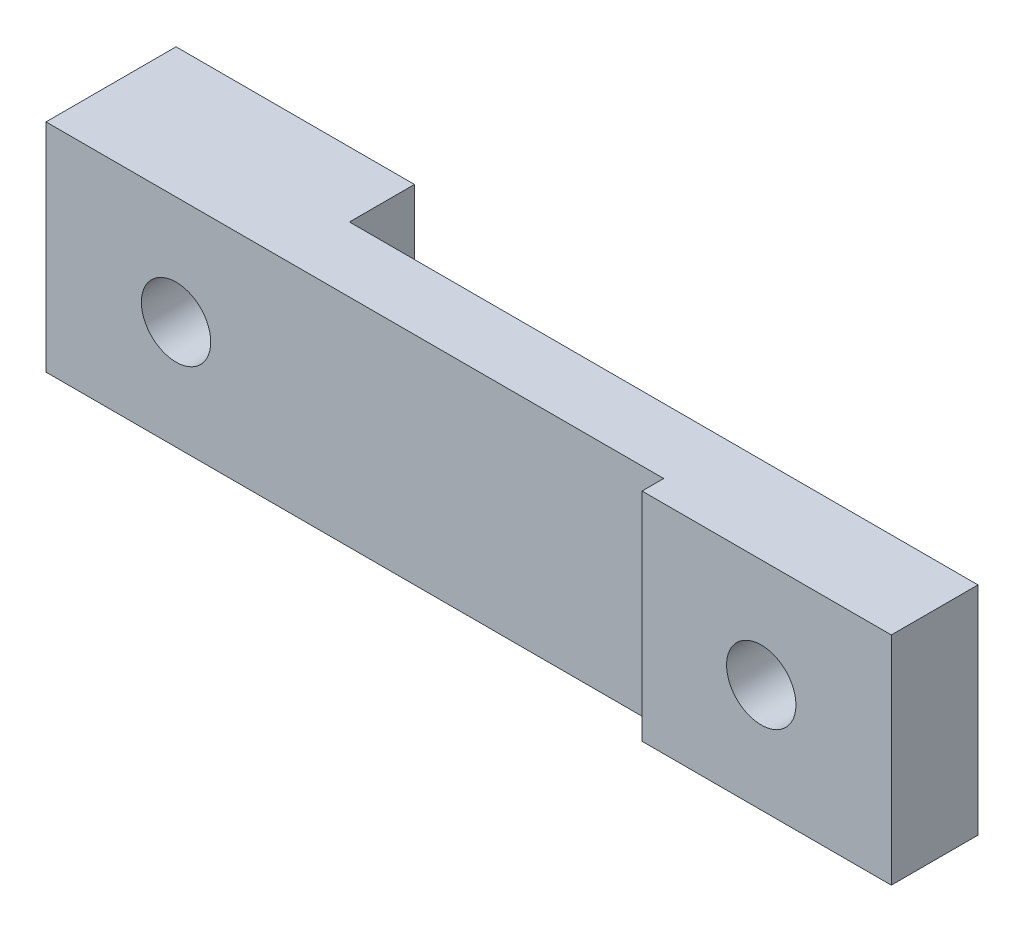
ISO-10303-21;
HEADER;
FILE_DESCRIPTION(('STEP AP214'),'2;1');
FILE_NAME('part.step','',(''),(''),'','','');
FILE_SCHEMA(('AUTOMOTIVE_DESIGN { 1 0 10303 214 1 1 1 1 }'));
ENDSEC;
DATA;
#1=APPLICATION_CONTEXT('core data for automotive mechanical design processes');
#2=APPLICATION_PROTOCOL_DEFINITION('international standard','automotive_design',2000,#1);
#3=PRODUCT_CONTEXT('',#1,'mechanical');
#4=PRODUCT('Part','Part','',(#3));
#5=PRODUCT_RELATED_PRODUCT_CATEGORY('part','',(#4));
#6=PRODUCT_DEFINITION_FORMATION('','',#4);
#7=PRODUCT_DEFINITION_CONTEXT('part definition',#1,'design');
#8=PRODUCT_DEFINITION('design','',#6,#7);
#9=PRODUCT_DEFINITION_SHAPE('','',#8);
#10=(LENGTH_UNIT() NAMED_UNIT(*) SI_UNIT(.MILLI.,.METRE.));
#11=(NAMED_UNIT(*) PLANE_ANGLE_UNIT() SI_UNIT($,.RADIAN.));
#12=(NAMED_UNIT(*) SI_UNIT($,.STERADIAN.) SOLID_ANGLE_UNIT());
#13=UNCERTAINTY_MEASURE_WITH_UNIT(LENGTH_MEASURE(1.E-05),#10,'distance_accuracy_value','');
#14=(GEOMETRIC_REPRESENTATION_CONTEXT(3) GLOBAL_UNCERTAINTY_ASSIGNED_CONTEXT((#13)) GLOBAL_UNIT_ASSIGNED_CONTEXT((#10,
#11,#12)) REPRESENTATION_CONTEXT('',''));
#15=CARTESIAN_POINT('',(0.,0.,0.));
#16=DIRECTION('',(0.,0.,1.));
#17=DIRECTION('',(1.,0.,0.));
#18=AXIS2_PLACEMENT_3D('',#15,#16,#17);
#19=CARTESIAN_POINT('',(-17.5,5.,3.));
#20=DIRECTION('',(0.,-1.,0.));
#21=DIRECTION('',(0.,0.,-1.));
#22=AXIS2_PLACEMENT_3D('',#19,#20,#21);
#23=PLANE('',#22);
#24=DIRECTION('',(0.,0.,-1.));
#25=VECTOR('',#24,1.);
#26=CARTESIAN_POINT('',(-20.,5.,-3.));
#27=LINE('',#26,#25);
#28=CARTESIAN_POINT('',(-20.,5.,3.));
#29=VERTEX_POINT('',#28);
#30=CARTESIAN_POINT('',(-20.,5.,-3.));
#31=VERTEX_POINT('',#30);
#32=EDGE_CURVE('E50',#29,#31,#27,.T.);
#33=ORIENTED_EDGE('',*,*,#32,.F.);
#34=DIRECTION('',(-1.,0.,0.));
#35=VECTOR('',#34,1.);
#36=CARTESIAN_POINT('',(-17.5,5.,3.));
#37=LINE('',#36,#35);
#38=CARTESIAN_POINT('',(8.5,5.,3.));
#39=VERTEX_POINT('',#38);
#40=EDGE_CURVE('E43',#39,#29,#37,.T.);
#41=ORIENTED_EDGE('',*,*,#40,.F.);
#42=DIRECTION('',(0.,0.,-1.));
#43=VECTOR('',#42,1.);
#44=CARTESIAN_POINT('',(8.5,5.,4.));
#45=LINE('',#44,#43);
#46=CARTESIAN_POINT('',(8.5,5.,4.));
#47=VERTEX_POINT('',#46);
#48=EDGE_CURVE('E139',#47,#39,#45,.T.);
#49=ORIENTED_EDGE('',*,*,#48,.F.);
#50=DIRECTION('',(-1.,0.,0.));
#51=VECTOR('',#50,1.);
#52=CARTESIAN_POINT('',(8.5,5.,4.));
#53=LINE('',#52,#51);
#54=CARTESIAN_POINT('',(20.,5.00000000000001,4.));
#55=VERTEX_POINT('',#54);
#56=EDGE_CURVE('E120',#55,#47,#53,.T.);
#57=ORIENTED_EDGE('',*,*,#56,.F.);
#58=DIRECTION('',(0.,0.,1.));
#59=VECTOR('',#58,1.);
#60=CARTESIAN_POINT('',(20.,5.00000000000001,4.));
#61=LINE('',#60,#59);
#62=CARTESIAN_POINT('',(20.,5.00000000000001,0.));
#63=VERTEX_POINT('',#62);
#64=EDGE_CURVE('E173',#63,#55,#61,.T.);
#65=ORIENTED_EDGE('',*,*,#64,.F.);
#66=DIRECTION('',(-1.,0.,0.));
#67=VECTOR('',#66,1.);
#68=CARTESIAN_POINT('',(-17.5,5.,0.));
#69=LINE('',#68,#67);
#70=CARTESIAN_POINT('',(-9.00000000000001,5.00000000000001,0.));
#71=VERTEX_POINT('',#70);
#72=EDGE_CURVE('E144',#63,#71,#69,.T.);
#73=ORIENTED_EDGE('',*,*,#72,.T.);
#74=DIRECTION('',(0.,0.,1.));
#75=VECTOR('',#74,1.);
#76=CARTESIAN_POINT('',(-9.00000000000001,5.00000000000001,0.));
#77=LINE('',#76,#75);
#78=CARTESIAN_POINT('',(-9.00000000000001,5.00000000000001,-3.));
#79=VERTEX_POINT('',#78);
#80=EDGE_CURVE('E228',#79,#71,#77,.T.);
#81=ORIENTED_EDGE('',*,*,#80,.F.);
#82=DIRECTION('',(1.,0.,0.));
#83=VECTOR('',#82,1.);
#84=CARTESIAN_POINT('',(-11.5,5.,-3.));
#85=LINE('',#84,#83);
#86=EDGE_CURVE('E118',#31,#79,#85,.T.);
#87=ORIENTED_EDGE('',*,*,#86,.F.);
#88=EDGE_LOOP('',(#33,#41,#49,#57,#65,#73,#81,#87));
#89=FACE_BOUND('',#88,.T.);
#90=ADVANCED_FACE('F35',(#89),#23,.F.);
#91=CARTESIAN_POINT('',(-17.5,-5.,3.));
#92=DIRECTION('',(0.,1.,0.));
#93=DIRECTION('',(0.,0.,1.));
#94=AXIS2_PLACEMENT_3D('',#91,#92,#93);
#95=PLANE('',#94);
#96=DIRECTION('',(0.,0.,1.));
#97=VECTOR('',#96,1.);
#98=CARTESIAN_POINT('',(-20.,-5.,-3.));
#99=LINE('',#98,#97);
#100=CARTESIAN_POINT('',(-20.,-5.,-3.));
#101=VERTEX_POINT('',#100);
#102=CARTESIAN_POINT('',(-20.,-5.,3.));
#103=VERTEX_POINT('',#102);
#104=EDGE_CURVE('E100',#101,#103,#99,.T.);
#105=ORIENTED_EDGE('',*,*,#104,.F.);
#106=DIRECTION('',(-1.,0.,0.));
#107=VECTOR('',#106,1.);
#108=CARTESIAN_POINT('',(-11.5,-5.,-3.));
#109=LINE('',#108,#107);
#110=CARTESIAN_POINT('',(-9.00000000000001,-5.,-3.));
#111=VERTEX_POINT('',#110);
#112=EDGE_CURVE('E109',#111,#101,#109,.T.);
#113=ORIENTED_EDGE('',*,*,#112,.F.);
#114=DIRECTION('',(0.,0.,-1.));
#115=VECTOR('',#114,1.);
#116=CARTESIAN_POINT('',(-9.00000000000001,-5.,0.));
#117=LINE('',#116,#115);
#118=CARTESIAN_POINT('',(-9.00000000000001,-5.,0.));
#119=VERTEX_POINT('',#118);
#120=EDGE_CURVE('E234',#119,#111,#117,.T.);
#121=ORIENTED_EDGE('',*,*,#120,.F.);
#122=DIRECTION('',(1.,0.,0.));
#123=VECTOR('',#122,1.);
#124=CARTESIAN_POINT('',(-17.5,-5.,0.));
#125=LINE('',#124,#123);
#126=CARTESIAN_POINT('',(20.,-5.,0.));
#127=VERTEX_POINT('',#126);
#128=EDGE_CURVE('E150',#119,#127,#125,.T.);
#129=ORIENTED_EDGE('',*,*,#128,.T.);
#130=DIRECTION('',(0.,0.,-1.));
#131=VECTOR('',#130,1.);
#132=CARTESIAN_POINT('',(20.,-5.,4.));
#133=LINE('',#132,#131);
#134=CARTESIAN_POINT('',(20.,-5.,4.));
#135=VERTEX_POINT('',#134);
#136=EDGE_CURVE('E180',#135,#127,#133,.T.);
#137=ORIENTED_EDGE('',*,*,#136,.F.);
#138=DIRECTION('',(1.,0.,0.));
#139=VECTOR('',#138,1.);
#140=CARTESIAN_POINT('',(8.5,-5.,4.));
#141=LINE('',#140,#139);
#142=CARTESIAN_POINT('',(8.5,-5.,4.));
#143=VERTEX_POINT('',#142);
#144=EDGE_CURVE('E129',#143,#135,#141,.T.);
#145=ORIENTED_EDGE('',*,*,#144,.F.);
#146=DIRECTION('',(0.,0.,-1.));
#147=VECTOR('',#146,1.);
#148=CARTESIAN_POINT('',(8.5,-5.,4.));
#149=LINE('',#148,#147);
#150=CARTESIAN_POINT('',(8.5,-5.,3.));
#151=VERTEX_POINT('',#150);
#152=EDGE_CURVE('E131',#143,#151,#149,.T.);
#153=ORIENTED_EDGE('',*,*,#152,.T.);
#154=DIRECTION('',(1.,0.,0.));
#155=VECTOR('',#154,1.);
#156=CARTESIAN_POINT('',(-17.5,-5.,3.));
#157=LINE('',#156,#155);
#158=EDGE_CURVE('E11',#103,#151,#157,.T.);
#159=ORIENTED_EDGE('',*,*,#158,.F.);
#160=EDGE_LOOP('',(#105,#113,#121,#129,#137,#145,#153,#159));
#161=FACE_BOUND('',#160,.T.);
#162=ADVANCED_FACE('F108',(#161),#95,.F.);
#163=CARTESIAN_POINT('',(0.,0.,3.));
#164=DIRECTION('',(0.,0.,1.));
#165=DIRECTION('',(1.,0.,0.));
#166=AXIS2_PLACEMENT_3D('',#163,#164,#165);
#167=PLANE('',#166);
#168=CARTESIAN_POINT('',(-14.,0.,3.));
#169=DIRECTION('',(0.,0.,1.));
#170=DIRECTION('',(1.,0.,0.));
#171=AXIS2_PLACEMENT_3D('',#168,#169,#170);
#172=CIRCLE('',#171,1.6);
#173=CARTESIAN_POINT('',(-12.4,0.,3.));
#174=VERTEX_POINT('',#173);
#175=EDGE_CURVE('E182',#174,#174,#172,.T.);
#176=ORIENTED_EDGE('',*,*,#175,.F.);
#177=EDGE_LOOP('',(#176));
#178=FACE_BOUND('',#177,.T.);
#179=ORIENTED_EDGE('',*,*,#40,.T.);
#180=DIRECTION('',(0.,1.,0.));
#181=VECTOR('',#180,1.);
#182=CARTESIAN_POINT('',(-20.,5.,3.));
#183=LINE('',#182,#181);
#184=EDGE_CURVE('E112',#103,#29,#183,.T.);
#185=ORIENTED_EDGE('',*,*,#184,.F.);
#186=ORIENTED_EDGE('',*,*,#158,.T.);
#187=DIRECTION('',(0.,-1.,0.));
#188=VECTOR('',#187,1.);
#189=CARTESIAN_POINT('',(8.5,5.,3.));
#190=LINE('',#189,#188);
#191=EDGE_CURVE('E57',#39,#151,#190,.T.);
#192=ORIENTED_EDGE('',*,*,#191,.F.);
#193=EDGE_LOOP('',(#179,#185,#186,#192));
#194=FACE_BOUND('',#193,.T.);
#195=ADVANCED_FACE('F157',(#178,#194),#167,.T.);
#196=CARTESIAN_POINT('',(0.,0.,-3.));
#197=DIRECTION('',(0.,0.,-1.));
#198=DIRECTION('',(-1.,0.,0.));
#199=AXIS2_PLACEMENT_3D('',#196,#197,#198);
#200=PLANE('',#199);
#201=CARTESIAN_POINT('',(-14.,0.,-3.));
#202=DIRECTION('',(0.,0.,-1.));
#203=DIRECTION('',(-1.,0.,0.));
#204=AXIS2_PLACEMENT_3D('',#201,#202,#203);
#205=CIRCLE('',#204,1.6);
#206=CARTESIAN_POINT('',(-15.6,0.,-3.));
#207=VERTEX_POINT('',#206);
#208=EDGE_CURVE('E226',#207,#207,#205,.T.);
#209=ORIENTED_EDGE('',*,*,#208,.F.);
#210=EDGE_LOOP('',(#209));
#211=FACE_BOUND('',#210,.T.);
#212=ORIENTED_EDGE('',*,*,#112,.T.);
#213=DIRECTION('',(0.,-1.,0.));
#214=VECTOR('',#213,1.);
#215=CARTESIAN_POINT('',(-20.,5.,-3.));
#216=LINE('',#215,#214);
#217=EDGE_CURVE('E97',#31,#101,#216,.T.);
#218=ORIENTED_EDGE('',*,*,#217,.F.);
#219=ORIENTED_EDGE('',*,*,#86,.T.);
#220=DIRECTION('',(0.,1.,0.));
#221=VECTOR('',#220,1.);
#222=CARTESIAN_POINT('',(-9.00000000000001,5.00000000000001,-3.));
#223=LINE('',#222,#221);
#224=EDGE_CURVE('E117',#111,#79,#223,.T.);
#225=ORIENTED_EDGE('',*,*,#224,.F.);
#226=EDGE_LOOP('',(#212,#218,#219,#225));
#227=FACE_BOUND('',#226,.T.);
#228=ADVANCED_FACE('F115',(#211,#227),#200,.T.);
#229=CARTESIAN_POINT('',(0.,0.,0.));
#230=DIRECTION('',(0.,0.,1.));
#231=DIRECTION('',(1.,0.,0.));
#232=AXIS2_PLACEMENT_3D('',#229,#230,#231);
#233=PLANE('',#232);
#234=ORIENTED_EDGE('',*,*,#128,.F.);
#235=DIRECTION('',(0.,-1.,0.));
#236=VECTOR('',#235,1.);
#237=CARTESIAN_POINT('',(-9.00000000000001,5.00000000000001,0.));
#238=LINE('',#237,#236);
#239=EDGE_CURVE('E236',#71,#119,#238,.T.);
#240=ORIENTED_EDGE('',*,*,#239,.F.);
#241=ORIENTED_EDGE('',*,*,#72,.F.);
#242=DIRECTION('',(0.,1.,0.));
#243=VECTOR('',#242,1.);
#244=CARTESIAN_POINT('',(20.,5.00000000000001,0.));
#245=LINE('',#244,#243);
#246=EDGE_CURVE('E178',#127,#63,#245,.T.);
#247=ORIENTED_EDGE('',*,*,#246,.F.);
#248=EDGE_LOOP('',(#234,#240,#241,#247));
#249=FACE_BOUND('',#248,.T.);
#250=CARTESIAN_POINT('',(14.,0.,0.));
#251=DIRECTION('',(0.,0.,1.));
#252=DIRECTION('',(1.,0.,0.));
#253=AXIS2_PLACEMENT_3D('',#250,#251,#252);
#254=CIRCLE('',#253,1.6);
#255=CARTESIAN_POINT('',(15.6,0.,0.));
#256=VERTEX_POINT('',#255);
#257=EDGE_CURVE('E186',#256,#256,#254,.T.);
#258=ORIENTED_EDGE('',*,*,#257,.T.);
#259=EDGE_LOOP('',(#258));
#260=FACE_BOUND('',#259,.T.);
#261=ADVANCED_FACE('F216',(#249,#260),#233,.F.);
#262=CARTESIAN_POINT('',(0.,0.,4.));
#263=DIRECTION('',(0.,0.,1.));
#264=DIRECTION('',(1.,0.,0.));
#265=AXIS2_PLACEMENT_3D('',#262,#263,#264);
#266=PLANE('',#265);
#267=ORIENTED_EDGE('',*,*,#144,.T.);
#268=DIRECTION('',(0.,-1.,0.));
#269=VECTOR('',#268,1.);
#270=CARTESIAN_POINT('',(20.,5.00000000000001,4.));
#271=LINE('',#270,#269);
#272=EDGE_CURVE('E170',#55,#135,#271,.T.);
#273=ORIENTED_EDGE('',*,*,#272,.F.);
#274=ORIENTED_EDGE('',*,*,#56,.T.);
#275=DIRECTION('',(0.,-1.,0.));
#276=VECTOR('',#275,1.);
#277=CARTESIAN_POINT('',(8.5,5.,4.));
#278=LINE('',#277,#276);
#279=EDGE_CURVE('E127',#47,#143,#278,.T.);
#280=ORIENTED_EDGE('',*,*,#279,.T.);
#281=EDGE_LOOP('',(#267,#273,#274,#280));
#282=FACE_BOUND('',#281,.T.);
#283=CARTESIAN_POINT('',(14.,0.,4.));
#284=DIRECTION('',(0.,0.,1.));
#285=DIRECTION('',(1.,0.,0.));
#286=AXIS2_PLACEMENT_3D('',#283,#284,#285);
#287=CIRCLE('',#286,1.6);
#288=CARTESIAN_POINT('',(15.6,0.,4.));
#289=VERTEX_POINT('',#288);
#290=EDGE_CURVE('E122',#289,#289,#287,.F.);
#291=ORIENTED_EDGE('',*,*,#290,.T.);
#292=EDGE_LOOP('',(#291));
#293=FACE_BOUND('',#292,.T.);
#294=ADVANCED_FACE('F166',(#282,#293),#266,.T.);
#295=CARTESIAN_POINT('',(8.5,5.,4.));
#296=DIRECTION('',(1.,0.,0.));
#297=DIRECTION('',(0.,0.,-1.));
#298=AXIS2_PLACEMENT_3D('',#295,#296,#297);
#299=PLANE('',#298);
#300=ORIENTED_EDGE('',*,*,#191,.T.);
#301=ORIENTED_EDGE('',*,*,#152,.F.);
#302=ORIENTED_EDGE('',*,*,#279,.F.);
#303=ORIENTED_EDGE('',*,*,#48,.T.);
#304=EDGE_LOOP('',(#300,#301,#302,#303));
#305=FACE_BOUND('',#304,.T.);
#306=ADVANCED_FACE('F162',(#305),#299,.F.);
#307=CARTESIAN_POINT('',(14.,0.,12.));
#308=DIRECTION('',(0.,0.,-1.));
#309=DIRECTION('',(-1.,0.,0.));
#310=AXIS2_PLACEMENT_3D('',#307,#308,#309);
#311=CYLINDRICAL_SURFACE('',#310,1.6);
#312=ORIENTED_EDGE('',*,*,#290,.F.);
#313=EDGE_LOOP('',(#312));
#314=FACE_BOUND('',#313,.T.);
#315=ORIENTED_EDGE('',*,*,#257,.F.);
#316=EDGE_LOOP('',(#315));
#317=FACE_BOUND('',#316,.T.);
#318=ADVANCED_FACE('F193',(#314,#317),#311,.F.);
#319=CARTESIAN_POINT('',(20.,0.,0.));
#320=DIRECTION('',(1.,0.,0.));
#321=DIRECTION('',(0.,1.,0.));
#322=AXIS2_PLACEMENT_3D('',#319,#320,#321);
#323=PLANE('',#322);
#324=ORIENTED_EDGE('',*,*,#246,.T.);
#325=ORIENTED_EDGE('',*,*,#64,.T.);
#326=ORIENTED_EDGE('',*,*,#272,.T.);
#327=ORIENTED_EDGE('',*,*,#136,.T.);
#328=EDGE_LOOP('',(#324,#325,#326,#327));
#329=FACE_BOUND('',#328,.T.);
#330=ADVANCED_FACE('F176',(#329),#323,.T.);
#331=CARTESIAN_POINT('',(-14.,0.,4.));
#332=DIRECTION('',(0.,0.,-1.));
#333=DIRECTION('',(-1.,0.,0.));
#334=AXIS2_PLACEMENT_3D('',#331,#332,#333);
#335=CYLINDRICAL_SURFACE('',#334,1.6);
#336=ORIENTED_EDGE('',*,*,#175,.T.);
#337=EDGE_LOOP('',(#336));
#338=FACE_BOUND('',#337,.T.);
#339=ORIENTED_EDGE('',*,*,#208,.T.);
#340=EDGE_LOOP('',(#339));
#341=FACE_BOUND('',#340,.T.);
#342=ADVANCED_FACE('F201',(#338,#341),#335,.F.);
#343=CARTESIAN_POINT('',(-9.00000000000001,0.,0.));
#344=DIRECTION('',(1.,0.,0.));
#345=DIRECTION('',(0.,0.,-1.));
#346=AXIS2_PLACEMENT_3D('',#343,#344,#345);
#347=PLANE('',#346);
#348=ORIENTED_EDGE('',*,*,#239,.T.);
#349=ORIENTED_EDGE('',*,*,#120,.T.);
#350=ORIENTED_EDGE('',*,*,#224,.T.);
#351=ORIENTED_EDGE('',*,*,#80,.T.);
#352=EDGE_LOOP('',(#348,#349,#350,#351));
#353=FACE_BOUND('',#352,.T.);
#354=ADVANCED_FACE('F242',(#353),#347,.T.);
#355=CARTESIAN_POINT('',(-20.,0.,0.));
#356=DIRECTION('',(-1.,0.,0.));
#357=DIRECTION('',(0.,0.,1.));
#358=AXIS2_PLACEMENT_3D('',#355,#356,#357);
#359=PLANE('',#358);
#360=ORIENTED_EDGE('',*,*,#217,.T.);
#361=ORIENTED_EDGE('',*,*,#104,.T.);
#362=ORIENTED_EDGE('',*,*,#184,.T.);
#363=ORIENTED_EDGE('',*,*,#32,.T.);
#364=EDGE_LOOP('',(#360,#361,#362,#363));
#365=FACE_BOUND('',#364,.T.);
#366=ADVANCED_FACE('F99',(#365),#359,.T.);
#367=CLOSED_SHELL('',(#90,#162,#195,#228,#261,#294,#306,#318,#330,#342,#354,#366));
#368=MANIFOLD_SOLID_BREP('B2',#367);
#369=ADVANCED_BREP_SHAPE_REPRESENTATION('',(#18,#368),#14);
#370=SHAPE_DEFINITION_REPRESENTATION(#9,#369);
ENDSEC;
END-ISO-10303-21;
